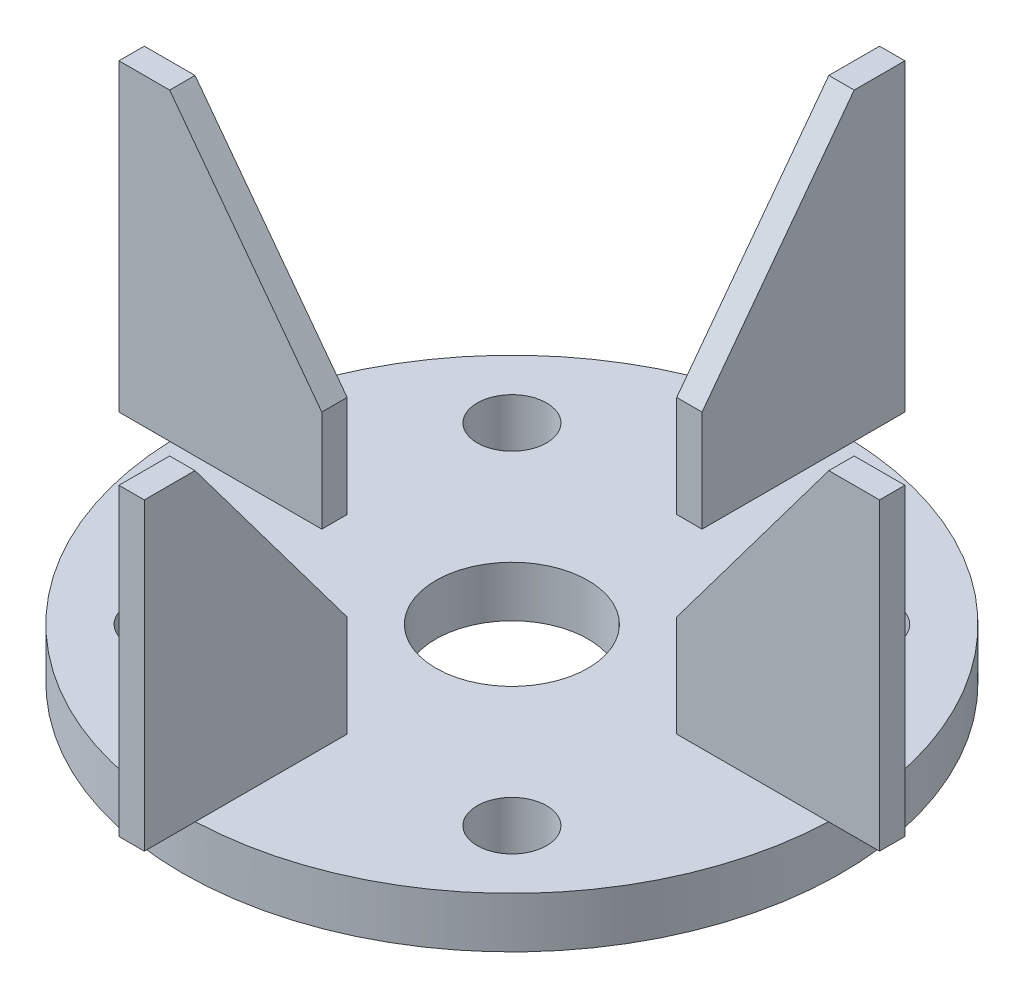
ISO-10303-21;
HEADER;
FILE_DESCRIPTION(('STEP AP214'),'2;1');
FILE_NAME('part.step','',(''),(''),'','','');
FILE_SCHEMA(('AUTOMOTIVE_DESIGN { 1 0 10303 214 1 1 1 1 }'));
ENDSEC;
DATA;
#1=APPLICATION_CONTEXT('core data for automotive mechanical design processes');
#2=APPLICATION_PROTOCOL_DEFINITION('international standard','automotive_design',2000,#1);
#3=PRODUCT_CONTEXT('',#1,'mechanical');
#4=PRODUCT('Part','Part','',(#3));
#5=PRODUCT_RELATED_PRODUCT_CATEGORY('part','',(#4));
#6=PRODUCT_DEFINITION_FORMATION('','',#4);
#7=PRODUCT_DEFINITION_CONTEXT('part definition',#1,'design');
#8=PRODUCT_DEFINITION('design','',#6,#7);
#9=PRODUCT_DEFINITION_SHAPE('','',#8);
#10=(LENGTH_UNIT() NAMED_UNIT(*) SI_UNIT(.MILLI.,.METRE.));
#11=(NAMED_UNIT(*) PLANE_ANGLE_UNIT() SI_UNIT($,.RADIAN.));
#12=(NAMED_UNIT(*) SI_UNIT($,.STERADIAN.) SOLID_ANGLE_UNIT());
#13=UNCERTAINTY_MEASURE_WITH_UNIT(LENGTH_MEASURE(1.E-05),#10,'distance_accuracy_value','');
#14=(GEOMETRIC_REPRESENTATION_CONTEXT(3) GLOBAL_UNCERTAINTY_ASSIGNED_CONTEXT((#13)) GLOBAL_UNIT_ASSIGNED_CONTEXT((#10,
#11,#12)) REPRESENTATION_CONTEXT('',''));
#15=CARTESIAN_POINT('',(0.,0.,0.));
#16=DIRECTION('',(0.,0.,1.));
#17=DIRECTION('',(1.,0.,0.));
#18=AXIS2_PLACEMENT_3D('',#15,#16,#17);
#19=CARTESIAN_POINT('',(0.,12.7,0.));
#20=DIRECTION('',(0.,1.,0.));
#21=DIRECTION('',(0.,0.,1.));
#22=AXIS2_PLACEMENT_3D('',#19,#20,#21);
#23=PLANE('',#22);
#24=CARTESIAN_POINT('',(43.6800284499293,12.7,-43.6800284499285));
#25=DIRECTION('',(0.,1.,0.));
#26=DIRECTION('',(0.,0.,1.));
#27=AXIS2_PLACEMENT_3D('',#24,#25,#26);
#28=CIRCLE('',#27,8.68663719831925);
#29=CARTESIAN_POINT('',(43.6800284499293,12.7,-34.9933912516093));
#30=VERTEX_POINT('',#29);
#31=EDGE_CURVE('E396',#30,#30,#28,.F.);
#32=ORIENTED_EDGE('',*,*,#31,.T.);
#33=EDGE_LOOP('',(#32));
#34=FACE_BOUND('',#33,.T.);
#35=CARTESIAN_POINT('',(-43.6800284499287,12.7,-43.6800284499291));
#36=DIRECTION('',(0.,1.,0.));
#37=DIRECTION('',(0.,0.,1.));
#38=AXIS2_PLACEMENT_3D('',#35,#36,#37);
#39=CIRCLE('',#38,8.68663719831925);
#40=CARTESIAN_POINT('',(-43.6800284499287,12.7,-34.9933912516099));
#41=VERTEX_POINT('',#40);
#42=EDGE_CURVE('E400',#41,#41,#39,.F.);
#43=ORIENTED_EDGE('',*,*,#42,.T.);
#44=EDGE_LOOP('',(#43));
#45=FACE_BOUND('',#44,.T.);
#46=CARTESIAN_POINT('',(-43.680028449929,12.7,43.6800284499289));
#47=DIRECTION('',(0.,1.,0.));
#48=DIRECTION('',(0.,0.,1.));
#49=AXIS2_PLACEMENT_3D('',#46,#47,#48);
#50=CIRCLE('',#49,8.68663719831924);
#51=CARTESIAN_POINT('',(-43.680028449929,12.7,52.3666656482481));
#52=VERTEX_POINT('',#51);
#53=EDGE_CURVE('E404',#52,#52,#50,.F.);
#54=ORIENTED_EDGE('',*,*,#53,.T.);
#55=EDGE_LOOP('',(#54));
#56=FACE_BOUND('',#55,.T.);
#57=CARTESIAN_POINT('',(43.680028449929,12.7,43.6800284499288));
#58=DIRECTION('',(0.,1.,0.));
#59=DIRECTION('',(0.,0.,1.));
#60=AXIS2_PLACEMENT_3D('',#57,#58,#59);
#61=CIRCLE('',#60,8.68663719831925);
#62=CARTESIAN_POINT('',(43.680028449929,12.7,52.3666656482481));
#63=VERTEX_POINT('',#62);
#64=EDGE_CURVE('E408',#63,#63,#61,.F.);
#65=ORIENTED_EDGE('',*,*,#64,.T.);
#66=EDGE_LOOP('',(#65));
#67=FACE_BOUND('',#66,.T.);
#68=CARTESIAN_POINT('',(0.,12.7,0.));
#69=DIRECTION('',(0.,1.,0.));
#70=DIRECTION('',(0.,0.,1.));
#71=AXIS2_PLACEMENT_3D('',#68,#69,#70);
#72=CIRCLE('',#71,19.05);
#73=CARTESIAN_POINT('',(0.,12.7,19.05));
#74=VERTEX_POINT('',#73);
#75=EDGE_CURVE('E346',#74,#74,#72,.T.);
#76=ORIENTED_EDGE('',*,*,#75,.F.);
#77=EDGE_LOOP('',(#76));
#78=FACE_BOUND('',#77,.T.);
#79=DIRECTION('',(0.,0.,-1.));
#80=VECTOR('',#79,1.);
#81=CARTESIAN_POINT('',(-44.45,12.7,3.17500000000047));
#82=LINE('',#81,#80);
#83=CARTESIAN_POINT('',(-44.45,12.7,3.17500000000047));
#84=VERTEX_POINT('',#83);
#85=CARTESIAN_POINT('',(-44.45,12.7,-3.17499999999953));
#86=VERTEX_POINT('',#85);
#87=EDGE_CURVE('E51',#84,#86,#82,.T.);
#88=ORIENTED_EDGE('',*,*,#87,.F.);
#89=DIRECTION('',(1.,0.,0.));
#90=VECTOR('',#89,1.);
#91=CARTESIAN_POINT('',(-44.45,12.7,3.17500000000047));
#92=LINE('',#91,#90);
#93=CARTESIAN_POINT('',(-82.4889197104678,12.7,3.17500000000086));
#94=VERTEX_POINT('',#93);
#95=EDGE_CURVE('E207',#94,#84,#92,.T.);
#96=ORIENTED_EDGE('',*,*,#95,.F.);
#97=CARTESIAN_POINT('',(0.,12.7,0.));
#98=DIRECTION('',(0.,1.,0.));
#99=DIRECTION('',(0.,0.,1.));
#100=AXIS2_PLACEMENT_3D('',#97,#98,#99);
#101=CIRCLE('',#100,82.55);
#102=CARTESIAN_POINT('',(-3.175,12.7,82.4889197104678));
#103=VERTEX_POINT('',#102);
#104=EDGE_CURVE('E353',#94,#103,#101,.T.);
#105=ORIENTED_EDGE('',*,*,#104,.T.);
#106=DIRECTION('',(0.,0.,-1.));
#107=VECTOR('',#106,1.);
#108=CARTESIAN_POINT('',(-3.175,12.7,44.45));
#109=LINE('',#108,#107);
#110=CARTESIAN_POINT('',(-3.175,12.7,44.45));
#111=VERTEX_POINT('',#110);
#112=EDGE_CURVE('E11',#103,#111,#109,.T.);
#113=ORIENTED_EDGE('',*,*,#112,.T.);
#114=DIRECTION('',(-1.,0.,0.));
#115=VECTOR('',#114,1.);
#116=CARTESIAN_POINT('',(3.175,12.7,44.45));
#117=LINE('',#116,#115);
#118=CARTESIAN_POINT('',(3.175,12.7,44.45));
#119=VERTEX_POINT('',#118);
#120=EDGE_CURVE('E336',#119,#111,#117,.T.);
#121=ORIENTED_EDGE('',*,*,#120,.F.);
#122=DIRECTION('',(0.,0.,-1.));
#123=VECTOR('',#122,1.);
#124=CARTESIAN_POINT('',(3.175,12.7,44.45));
#125=LINE('',#124,#123);
#126=CARTESIAN_POINT('',(3.175,12.7,82.4889197104678));
#127=VERTEX_POINT('',#126);
#128=EDGE_CURVE('E42',#127,#119,#125,.T.);
#129=ORIENTED_EDGE('',*,*,#128,.F.);
#130=CARTESIAN_POINT('',(82.4889197104678,12.7,3.17499999999971));
#131=VERTEX_POINT('',#130);
#132=EDGE_CURVE('E350',#127,#131,#101,.T.);
#133=ORIENTED_EDGE('',*,*,#132,.T.);
#134=DIRECTION('',(-1.,0.,0.));
#135=VECTOR('',#134,1.);
#136=CARTESIAN_POINT('',(44.45,12.7,3.17499999999984));
#137=LINE('',#136,#135);
#138=CARTESIAN_POINT('',(44.45,12.7,3.17499999999984));
#139=VERTEX_POINT('',#138);
#140=EDGE_CURVE('E287',#131,#139,#137,.T.);
#141=ORIENTED_EDGE('',*,*,#140,.T.);
#142=DIRECTION('',(0.,0.,1.));
#143=VECTOR('',#142,1.);
#144=CARTESIAN_POINT('',(44.45,12.7,-3.17500000000016));
#145=LINE('',#144,#143);
#146=CARTESIAN_POINT('',(44.45,12.7,-3.17500000000016));
#147=VERTEX_POINT('',#146);
#148=EDGE_CURVE('E299',#147,#139,#145,.T.);
#149=ORIENTED_EDGE('',*,*,#148,.F.);
#150=DIRECTION('',(-1.,0.,0.));
#151=VECTOR('',#150,1.);
#152=CARTESIAN_POINT('',(44.45,12.7,-3.17500000000016));
#153=LINE('',#152,#151);
#154=CARTESIAN_POINT('',(82.4889197104678,12.7,-3.17500000000029));
#155=VERTEX_POINT('',#154);
#156=EDGE_CURVE('E274',#155,#147,#153,.T.);
#157=ORIENTED_EDGE('',*,*,#156,.F.);
#158=CARTESIAN_POINT('',(3.175,12.7,-82.4889197104678));
#159=VERTEX_POINT('',#158);
#160=EDGE_CURVE('E359',#155,#159,#101,.T.);
#161=ORIENTED_EDGE('',*,*,#160,.T.);
#162=DIRECTION('',(0.,0.,1.));
#163=VECTOR('',#162,1.);
#164=CARTESIAN_POINT('',(3.175,12.7,-44.45));
#165=LINE('',#164,#163);
#166=CARTESIAN_POINT('',(3.175,12.7,-44.45));
#167=VERTEX_POINT('',#166);
#168=EDGE_CURVE('E246',#159,#167,#165,.T.);
#169=ORIENTED_EDGE('',*,*,#168,.T.);
#170=DIRECTION('',(1.,0.,0.));
#171=VECTOR('',#170,1.);
#172=CARTESIAN_POINT('',(-3.175,12.7,-44.45));
#173=LINE('',#172,#171);
#174=CARTESIAN_POINT('',(-3.175,12.7,-44.45));
#175=VERTEX_POINT('',#174);
#176=EDGE_CURVE('E258',#175,#167,#173,.T.);
#177=ORIENTED_EDGE('',*,*,#176,.F.);
#178=DIRECTION('',(0.,0.,1.));
#179=VECTOR('',#178,1.);
#180=CARTESIAN_POINT('',(-3.175,12.7,-44.45));
#181=LINE('',#180,#179);
#182=CARTESIAN_POINT('',(-3.175,12.7,-82.4889197104678));
#183=VERTEX_POINT('',#182);
#184=EDGE_CURVE('E236',#183,#175,#181,.T.);
#185=ORIENTED_EDGE('',*,*,#184,.F.);
#186=CARTESIAN_POINT('',(-82.4889197104678,12.7,-3.17499999999914));
#187=VERTEX_POINT('',#186);
#188=EDGE_CURVE('E591',#183,#187,#101,.T.);
#189=ORIENTED_EDGE('',*,*,#188,.T.);
#190=DIRECTION('',(1.,0.,0.));
#191=VECTOR('',#190,1.);
#192=CARTESIAN_POINT('',(-44.45,12.7,-3.17499999999953));
#193=LINE('',#192,#191);
#194=EDGE_CURVE('E56',#187,#86,#193,.T.);
#195=ORIENTED_EDGE('',*,*,#194,.T.);
#196=EDGE_LOOP('',(#88,#96,#105,#113,#121,#129,#133,#141,#149,#157,#161,#169,#177,#185,#189,#195));
#197=FACE_BOUND('',#196,.T.);
#198=ADVANCED_FACE('F33',(#34,#45,#56,#67,#78,#197),#23,.T.);
#199=CARTESIAN_POINT('',(0.,0.,0.));
#200=DIRECTION('',(0.,1.,0.));
#201=DIRECTION('',(0.,0.,1.));
#202=AXIS2_PLACEMENT_3D('',#199,#200,#201);
#203=PLANE('',#202);
#204=CARTESIAN_POINT('',(43.6800284499293,0.,-43.6800284499285));
#205=DIRECTION('',(0.,1.,0.));
#206=DIRECTION('',(0.,0.,1.));
#207=AXIS2_PLACEMENT_3D('',#204,#205,#206);
#208=CIRCLE('',#207,8.68663719831925);
#209=CARTESIAN_POINT('',(43.6800284499293,0.,-34.9933912516093));
#210=VERTEX_POINT('',#209);
#211=EDGE_CURVE('E762',#210,#210,#208,.T.);
#212=ORIENTED_EDGE('',*,*,#211,.T.);
#213=EDGE_LOOP('',(#212));
#214=FACE_BOUND('',#213,.T.);
#215=CARTESIAN_POINT('',(-43.6800284499287,0.,-43.6800284499291));
#216=DIRECTION('',(0.,1.,0.));
#217=DIRECTION('',(0.,0.,1.));
#218=AXIS2_PLACEMENT_3D('',#215,#216,#217);
#219=CIRCLE('',#218,8.68663719831925);
#220=CARTESIAN_POINT('',(-43.6800284499287,0.,-34.9933912516099));
#221=VERTEX_POINT('',#220);
#222=EDGE_CURVE('E763',#221,#221,#219,.T.);
#223=ORIENTED_EDGE('',*,*,#222,.T.);
#224=EDGE_LOOP('',(#223));
#225=FACE_BOUND('',#224,.T.);
#226=CARTESIAN_POINT('',(-43.680028449929,0.,43.6800284499289));
#227=DIRECTION('',(0.,1.,0.));
#228=DIRECTION('',(0.,0.,1.));
#229=AXIS2_PLACEMENT_3D('',#226,#227,#228);
#230=CIRCLE('',#229,8.68663719831924);
#231=CARTESIAN_POINT('',(-43.680028449929,0.,52.3666656482481));
#232=VERTEX_POINT('',#231);
#233=EDGE_CURVE('E415',#232,#232,#230,.T.);
#234=ORIENTED_EDGE('',*,*,#233,.T.);
#235=EDGE_LOOP('',(#234));
#236=FACE_BOUND('',#235,.T.);
#237=CARTESIAN_POINT('',(43.680028449929,0.,43.6800284499288));
#238=DIRECTION('',(0.,1.,0.));
#239=DIRECTION('',(0.,0.,1.));
#240=AXIS2_PLACEMENT_3D('',#237,#238,#239);
#241=CIRCLE('',#240,8.68663719831925);
#242=CARTESIAN_POINT('',(43.680028449929,0.,52.3666656482481));
#243=VERTEX_POINT('',#242);
#244=EDGE_CURVE('E411',#243,#243,#241,.T.);
#245=ORIENTED_EDGE('',*,*,#244,.T.);
#246=EDGE_LOOP('',(#245));
#247=FACE_BOUND('',#246,.T.);
#248=CARTESIAN_POINT('',(0.,0.,0.));
#249=DIRECTION('',(0.,1.,0.));
#250=DIRECTION('',(0.,0.,1.));
#251=AXIS2_PLACEMENT_3D('',#248,#249,#250);
#252=CIRCLE('',#251,82.55);
#253=CARTESIAN_POINT('',(0.,0.,82.55));
#254=VERTEX_POINT('',#253);
#255=EDGE_CURVE('E37',#254,#254,#252,.T.);
#256=ORIENTED_EDGE('',*,*,#255,.F.);
#257=EDGE_LOOP('',(#256));
#258=FACE_BOUND('',#257,.T.);
#259=CARTESIAN_POINT('',(0.,0.,0.));
#260=DIRECTION('',(0.,1.,0.));
#261=DIRECTION('',(0.,0.,1.));
#262=AXIS2_PLACEMENT_3D('',#259,#260,#261);
#263=CIRCLE('',#262,19.05);
#264=CARTESIAN_POINT('',(0.,0.,19.05));
#265=VERTEX_POINT('',#264);
#266=EDGE_CURVE('E345',#265,#265,#263,.T.);
#267=ORIENTED_EDGE('',*,*,#266,.T.);
#268=EDGE_LOOP('',(#267));
#269=FACE_BOUND('',#268,.T.);
#270=ADVANCED_FACE('F369',(#214,#225,#236,#247,#258,#269),#203,.F.);
#271=CARTESIAN_POINT('',(0.,12.7,0.));
#272=DIRECTION('',(0.,-1.,0.));
#273=DIRECTION('',(0.,0.,-1.));
#274=AXIS2_PLACEMENT_3D('',#271,#272,#273);
#275=CYLINDRICAL_SURFACE('',#274,82.55);
#276=ORIENTED_EDGE('',*,*,#132,.F.);
#277=EDGE_CURVE('E354',#103,#127,#101,.T.);
#278=ORIENTED_EDGE('',*,*,#277,.F.);
#279=ORIENTED_EDGE('',*,*,#104,.F.);
#280=EDGE_CURVE('E360',#187,#94,#101,.T.);
#281=ORIENTED_EDGE('',*,*,#280,.F.);
#282=ORIENTED_EDGE('',*,*,#188,.F.);
#283=EDGE_CURVE('E575',#159,#183,#101,.T.);
#284=ORIENTED_EDGE('',*,*,#283,.F.);
#285=ORIENTED_EDGE('',*,*,#160,.F.);
#286=EDGE_CURVE('E352',#131,#155,#101,.T.);
#287=ORIENTED_EDGE('',*,*,#286,.F.);
#288=EDGE_LOOP('',(#276,#278,#279,#281,#282,#284,#285,#287));
#289=FACE_BOUND('',#288,.T.);
#290=ORIENTED_EDGE('',*,*,#255,.T.);
#291=EDGE_LOOP('',(#290));
#292=FACE_BOUND('',#291,.T.);
#293=ADVANCED_FACE('F35',(#289,#292),#275,.T.);
#294=CARTESIAN_POINT('',(0.,12.7,0.));
#295=DIRECTION('',(0.,-1.,0.));
#296=DIRECTION('',(0.,0.,-1.));
#297=AXIS2_PLACEMENT_3D('',#294,#295,#296);
#298=CYLINDRICAL_SURFACE('',#297,19.05);
#299=ORIENTED_EDGE('',*,*,#75,.T.);
#300=EDGE_LOOP('',(#299));
#301=FACE_BOUND('',#300,.T.);
#302=ORIENTED_EDGE('',*,*,#266,.F.);
#303=EDGE_LOOP('',(#302));
#304=FACE_BOUND('',#303,.T.);
#305=ADVANCED_FACE('F375',(#301,#304),#298,.F.);
#306=CARTESIAN_POINT('',(3.175,12.7,44.45));
#307=DIRECTION('',(0.,1.,0.));
#308=DIRECTION('',(0.,0.,1.));
#309=AXIS2_PLACEMENT_3D('',#306,#307,#308);
#310=PLANE('',#309);
#311=CARTESIAN_POINT('',(-3.175,12.7,95.25));
#312=VERTEX_POINT('',#311);
#313=EDGE_CURVE('E44',#312,#103,#109,.T.);
#314=ORIENTED_EDGE('',*,*,#313,.T.);
#315=ORIENTED_EDGE('',*,*,#277,.T.);
#316=CARTESIAN_POINT('',(3.175,12.7,95.25));
#317=VERTEX_POINT('',#316);
#318=EDGE_CURVE('E315',#317,#127,#125,.T.);
#319=ORIENTED_EDGE('',*,*,#318,.F.);
#320=DIRECTION('',(-1.,0.,0.));
#321=VECTOR('',#320,1.);
#322=CARTESIAN_POINT('',(3.175,12.7,95.25));
#323=LINE('',#322,#321);
#324=EDGE_CURVE('E339',#317,#312,#323,.T.);
#325=ORIENTED_EDGE('',*,*,#324,.T.);
#326=EDGE_LOOP('',(#314,#315,#319,#325));
#327=FACE_BOUND('',#326,.T.);
#328=ADVANCED_FACE('F377',(#327),#310,.F.);
#329=CARTESIAN_POINT('',(3.175,88.9,82.55));
#330=DIRECTION('',(0.,-1.,0.));
#331=DIRECTION('',(0.,0.,-1.));
#332=AXIS2_PLACEMENT_3D('',#329,#330,#331);
#333=PLANE('',#332);
#334=DIRECTION('',(0.,0.,1.));
#335=VECTOR('',#334,1.);
#336=CARTESIAN_POINT('',(-3.175,88.9,82.55));
#337=LINE('',#336,#335);
#338=CARTESIAN_POINT('',(-3.175,88.9,82.55));
#339=VERTEX_POINT('',#338);
#340=CARTESIAN_POINT('',(-3.175,88.9,95.25));
#341=VERTEX_POINT('',#340);
#342=EDGE_CURVE('E308',#339,#341,#337,.T.);
#343=ORIENTED_EDGE('',*,*,#342,.T.);
#344=DIRECTION('',(-1.,0.,0.));
#345=VECTOR('',#344,1.);
#346=CARTESIAN_POINT('',(3.175,88.9,95.25));
#347=LINE('',#346,#345);
#348=CARTESIAN_POINT('',(3.175,88.9,95.25));
#349=VERTEX_POINT('',#348);
#350=EDGE_CURVE('E342',#349,#341,#347,.T.);
#351=ORIENTED_EDGE('',*,*,#350,.F.);
#352=DIRECTION('',(0.,0.,1.));
#353=VECTOR('',#352,1.);
#354=CARTESIAN_POINT('',(3.175,88.9,82.55));
#355=LINE('',#354,#353);
#356=CARTESIAN_POINT('',(3.175,88.9,82.55));
#357=VERTEX_POINT('',#356);
#358=EDGE_CURVE('E309',#357,#349,#355,.T.);
#359=ORIENTED_EDGE('',*,*,#358,.F.);
#360=DIRECTION('',(-1.,0.,0.));
#361=VECTOR('',#360,1.);
#362=CARTESIAN_POINT('',(3.175,88.9,82.55));
#363=LINE('',#362,#361);
#364=EDGE_CURVE('E322',#357,#339,#363,.T.);
#365=ORIENTED_EDGE('',*,*,#364,.T.);
#366=EDGE_LOOP('',(#343,#351,#359,#365));
#367=FACE_BOUND('',#366,.T.);
#368=ADVANCED_FACE('F384',(#367),#333,.F.);
#369=CARTESIAN_POINT('',(3.175,12.7,95.25));
#370=DIRECTION('',(0.,0.,-1.));
#371=DIRECTION('',(-1.,0.,0.));
#372=AXIS2_PLACEMENT_3D('',#369,#370,#371);
#373=PLANE('',#372);
#374=DIRECTION('',(0.,-1.,0.));
#375=VECTOR('',#374,1.);
#376=CARTESIAN_POINT('',(-3.175,12.7,95.25));
#377=LINE('',#376,#375);
#378=EDGE_CURVE('E325',#341,#312,#377,.T.);
#379=ORIENTED_EDGE('',*,*,#378,.T.);
#380=ORIENTED_EDGE('',*,*,#324,.F.);
#381=DIRECTION('',(0.,-1.,0.));
#382=VECTOR('',#381,1.);
#383=CARTESIAN_POINT('',(3.175,12.7,95.25));
#384=LINE('',#383,#382);
#385=EDGE_CURVE('E312',#349,#317,#384,.T.);
#386=ORIENTED_EDGE('',*,*,#385,.F.);
#387=ORIENTED_EDGE('',*,*,#350,.T.);
#388=EDGE_LOOP('',(#379,#380,#386,#387));
#389=FACE_BOUND('',#388,.T.);
#390=ADVANCED_FACE('F538',(#389),#373,.F.);
#391=CARTESIAN_POINT('',(3.175,38.1,44.45));
#392=DIRECTION('',(0.,0.,1.));
#393=DIRECTION('',(0.,-1.,0.));
#394=AXIS2_PLACEMENT_3D('',#391,#392,#393);
#395=PLANE('',#394);
#396=DIRECTION('',(0.,1.,0.));
#397=VECTOR('',#396,1.);
#398=CARTESIAN_POINT('',(-3.175,38.1,44.45));
#399=LINE('',#398,#397);
#400=CARTESIAN_POINT('',(-3.175,38.1,44.45));
#401=VERTEX_POINT('',#400);
#402=EDGE_CURVE('E328',#111,#401,#399,.T.);
#403=ORIENTED_EDGE('',*,*,#402,.T.);
#404=DIRECTION('',(-1.,0.,0.));
#405=VECTOR('',#404,1.);
#406=CARTESIAN_POINT('',(3.175,38.1,44.45));
#407=LINE('',#406,#405);
#408=CARTESIAN_POINT('',(3.175,38.1,44.45));
#409=VERTEX_POINT('',#408);
#410=EDGE_CURVE('E333',#409,#401,#407,.T.);
#411=ORIENTED_EDGE('',*,*,#410,.F.);
#412=DIRECTION('',(0.,1.,0.));
#413=VECTOR('',#412,1.);
#414=CARTESIAN_POINT('',(3.175,38.1,44.45));
#415=LINE('',#414,#413);
#416=EDGE_CURVE('E318',#119,#409,#415,.T.);
#417=ORIENTED_EDGE('',*,*,#416,.F.);
#418=ORIENTED_EDGE('',*,*,#120,.T.);
#419=EDGE_LOOP('',(#403,#411,#417,#418));
#420=FACE_BOUND('',#419,.T.);
#421=ADVANCED_FACE('F535',(#420),#395,.F.);
#422=CARTESIAN_POINT('',(3.175,88.9,82.55));
#423=DIRECTION('',(0.,-0.6,0.8));
#424=DIRECTION('',(0.,-0.8,-0.6));
#425=AXIS2_PLACEMENT_3D('',#422,#423,#424);
#426=PLANE('',#425);
#427=DIRECTION('',(0.,0.8,0.6));
#428=VECTOR('',#427,1.);
#429=CARTESIAN_POINT('',(-3.175,88.9,82.55));
#430=LINE('',#429,#428);
#431=EDGE_CURVE('E313',#401,#339,#430,.T.);
#432=ORIENTED_EDGE('',*,*,#431,.T.);
#433=ORIENTED_EDGE('',*,*,#364,.F.);
#434=DIRECTION('',(0.,0.8,0.6));
#435=VECTOR('',#434,1.);
#436=CARTESIAN_POINT('',(3.175,88.9,82.55));
#437=LINE('',#436,#435);
#438=EDGE_CURVE('E320',#409,#357,#437,.T.);
#439=ORIENTED_EDGE('',*,*,#438,.F.);
#440=ORIENTED_EDGE('',*,*,#410,.T.);
#441=EDGE_LOOP('',(#432,#433,#439,#440));
#442=FACE_BOUND('',#441,.T.);
#443=ADVANCED_FACE('F528',(#442),#426,.F.);
#444=CARTESIAN_POINT('',(3.175,0.,0.));
#445=DIRECTION('',(-1.,0.,0.));
#446=DIRECTION('',(0.,0.,1.));
#447=AXIS2_PLACEMENT_3D('',#444,#445,#446);
#448=PLANE('',#447);
#449=ORIENTED_EDGE('',*,*,#358,.T.);
#450=ORIENTED_EDGE('',*,*,#385,.T.);
#451=ORIENTED_EDGE('',*,*,#318,.T.);
#452=ORIENTED_EDGE('',*,*,#128,.T.);
#453=ORIENTED_EDGE('',*,*,#416,.T.);
#454=ORIENTED_EDGE('',*,*,#438,.T.);
#455=EDGE_LOOP('',(#449,#450,#451,#452,#453,#454));
#456=FACE_BOUND('',#455,.T.);
#457=ADVANCED_FACE('F525',(#456),#448,.F.);
#458=CARTESIAN_POINT('',(-3.175,0.,0.));
#459=DIRECTION('',(-1.,0.,0.));
#460=DIRECTION('',(0.,0.,1.));
#461=AXIS2_PLACEMENT_3D('',#458,#459,#460);
#462=PLANE('',#461);
#463=ORIENTED_EDGE('',*,*,#342,.F.);
#464=ORIENTED_EDGE('',*,*,#431,.F.);
#465=ORIENTED_EDGE('',*,*,#402,.F.);
#466=ORIENTED_EDGE('',*,*,#112,.F.);
#467=ORIENTED_EDGE('',*,*,#313,.F.);
#468=ORIENTED_EDGE('',*,*,#378,.F.);
#469=EDGE_LOOP('',(#463,#464,#465,#466,#467,#468));
#470=FACE_BOUND('',#469,.T.);
#471=ADVANCED_FACE('F523',(#470),#462,.T.);
#472=CARTESIAN_POINT('',(82.55,88.9,-3.17500000000029));
#473=DIRECTION('',(0.,-1.,0.));
#474=DIRECTION('',(0.,0.,-1.));
#475=AXIS2_PLACEMENT_3D('',#472,#473,#474);
#476=PLANE('',#475);
#477=DIRECTION('',(1.,0.,0.));
#478=VECTOR('',#477,1.);
#479=CARTESIAN_POINT('',(82.55,88.9,3.17499999999971));
#480=LINE('',#479,#478);
#481=CARTESIAN_POINT('',(82.55,88.9,3.17499999999971));
#482=VERTEX_POINT('',#481);
#483=CARTESIAN_POINT('',(95.25,88.9,3.17499999999967));
#484=VERTEX_POINT('',#483);
#485=EDGE_CURVE('E267',#482,#484,#480,.T.);
#486=ORIENTED_EDGE('',*,*,#485,.T.);
#487=DIRECTION('',(0.,0.,1.));
#488=VECTOR('',#487,1.);
#489=CARTESIAN_POINT('',(95.25,88.9,-3.17500000000033));
#490=LINE('',#489,#488);
#491=CARTESIAN_POINT('',(95.25,88.9,-3.17500000000033));
#492=VERTEX_POINT('',#491);
#493=EDGE_CURVE('E305',#492,#484,#490,.T.);
#494=ORIENTED_EDGE('',*,*,#493,.F.);
#495=DIRECTION('',(1.,0.,0.));
#496=VECTOR('',#495,1.);
#497=CARTESIAN_POINT('',(82.55,88.9,-3.17500000000029));
#498=LINE('',#497,#496);
#499=CARTESIAN_POINT('',(82.55,88.9,-3.17500000000029));
#500=VERTEX_POINT('',#499);
#501=EDGE_CURVE('E268',#500,#492,#498,.T.);
#502=ORIENTED_EDGE('',*,*,#501,.F.);
#503=DIRECTION('',(0.,0.,1.));
#504=VECTOR('',#503,1.);
#505=CARTESIAN_POINT('',(82.55,88.9,-3.17500000000029));
#506=LINE('',#505,#504);
#507=EDGE_CURVE('E282',#500,#482,#506,.T.);
#508=ORIENTED_EDGE('',*,*,#507,.T.);
#509=EDGE_LOOP('',(#486,#494,#502,#508));
#510=FACE_BOUND('',#509,.T.);
#511=ADVANCED_FACE('F519',(#510),#476,.F.);
#512=CARTESIAN_POINT('',(95.25,12.7,-3.17500000000033));
#513=DIRECTION('',(-1.,0.,0.));
#514=DIRECTION('',(0.,0.,1.));
#515=AXIS2_PLACEMENT_3D('',#512,#513,#514);
#516=PLANE('',#515);
#517=DIRECTION('',(0.,-1.,0.));
#518=VECTOR('',#517,1.);
#519=CARTESIAN_POINT('',(95.25,12.7,3.17499999999967));
#520=LINE('',#519,#518);
#521=CARTESIAN_POINT('',(95.25,12.7,3.17499999999967));
#522=VERTEX_POINT('',#521);
#523=EDGE_CURVE('E285',#484,#522,#520,.T.);
#524=ORIENTED_EDGE('',*,*,#523,.T.);
#525=DIRECTION('',(0.,0.,1.));
#526=VECTOR('',#525,1.);
#527=CARTESIAN_POINT('',(95.25,12.7,-3.17500000000033));
#528=LINE('',#527,#526);
#529=CARTESIAN_POINT('',(95.25,12.7,-3.17500000000033));
#530=VERTEX_POINT('',#529);
#531=EDGE_CURVE('E302',#530,#522,#528,.T.);
#532=ORIENTED_EDGE('',*,*,#531,.F.);
#533=DIRECTION('',(0.,-1.,0.));
#534=VECTOR('',#533,1.);
#535=CARTESIAN_POINT('',(95.25,12.7,-3.17500000000033));
#536=LINE('',#535,#534);
#537=EDGE_CURVE('E271',#492,#530,#536,.T.);
#538=ORIENTED_EDGE('',*,*,#537,.F.);
#539=ORIENTED_EDGE('',*,*,#493,.T.);
#540=EDGE_LOOP('',(#524,#532,#538,#539));
#541=FACE_BOUND('',#540,.T.);
#542=ADVANCED_FACE('F515',(#541),#516,.F.);
#543=CARTESIAN_POINT('',(44.45,12.7,-3.17500000000016));
#544=DIRECTION('',(0.,1.,0.));
#545=DIRECTION('',(-1.,0.,0.));
#546=AXIS2_PLACEMENT_3D('',#543,#544,#545);
#547=PLANE('',#546);
#548=EDGE_CURVE('E288',#522,#131,#137,.T.);
#549=ORIENTED_EDGE('',*,*,#548,.T.);
#550=ORIENTED_EDGE('',*,*,#286,.T.);
#551=EDGE_CURVE('E275',#530,#155,#153,.T.);
#552=ORIENTED_EDGE('',*,*,#551,.F.);
#553=ORIENTED_EDGE('',*,*,#531,.T.);
#554=EDGE_LOOP('',(#549,#550,#552,#553));
#555=FACE_BOUND('',#554,.T.);
#556=ADVANCED_FACE('F511',(#555),#547,.F.);
#557=CARTESIAN_POINT('',(44.45,38.1,-3.17500000000016));
#558=DIRECTION('',(1.,0.,0.));
#559=DIRECTION('',(0.,0.,-1.));
#560=AXIS2_PLACEMENT_3D('',#557,#558,#559);
#561=PLANE('',#560);
#562=DIRECTION('',(0.,1.,0.));
#563=VECTOR('',#562,1.);
#564=CARTESIAN_POINT('',(44.45,38.1,3.17499999999984));
#565=LINE('',#564,#563);
#566=CARTESIAN_POINT('',(44.45,38.1,3.17499999999984));
#567=VERTEX_POINT('',#566);
#568=EDGE_CURVE('E291',#139,#567,#565,.T.);
#569=ORIENTED_EDGE('',*,*,#568,.T.);
#570=DIRECTION('',(0.,0.,1.));
#571=VECTOR('',#570,1.);
#572=CARTESIAN_POINT('',(44.45,38.1,-3.17500000000016));
#573=LINE('',#572,#571);
#574=CARTESIAN_POINT('',(44.45,38.1,-3.17500000000016));
#575=VERTEX_POINT('',#574);
#576=EDGE_CURVE('E296',#575,#567,#573,.T.);
#577=ORIENTED_EDGE('',*,*,#576,.F.);
#578=DIRECTION('',(0.,1.,0.));
#579=VECTOR('',#578,1.);
#580=CARTESIAN_POINT('',(44.45,38.1,-3.17500000000016));
#581=LINE('',#580,#579);
#582=EDGE_CURVE('E278',#147,#575,#581,.T.);
#583=ORIENTED_EDGE('',*,*,#582,.F.);
#584=ORIENTED_EDGE('',*,*,#148,.T.);
#585=EDGE_LOOP('',(#569,#577,#583,#584));
#586=FACE_BOUND('',#585,.T.);
#587=ADVANCED_FACE('F507',(#586),#561,.F.);
#588=CARTESIAN_POINT('',(82.55,88.9,-3.17500000000029));
#589=DIRECTION('',(0.8,-0.6,0.));
#590=DIRECTION('',(0.6,0.8,0.));
#591=AXIS2_PLACEMENT_3D('',#588,#589,#590);
#592=PLANE('',#591);
#593=DIRECTION('',(0.6,0.8,0.));
#594=VECTOR('',#593,1.);
#595=CARTESIAN_POINT('',(82.55,88.9,3.17499999999971));
#596=LINE('',#595,#594);
#597=EDGE_CURVE('E272',#567,#482,#596,.T.);
#598=ORIENTED_EDGE('',*,*,#597,.T.);
#599=ORIENTED_EDGE('',*,*,#507,.F.);
#600=DIRECTION('',(0.6,0.8,0.));
#601=VECTOR('',#600,1.);
#602=CARTESIAN_POINT('',(82.55,88.9,-3.17500000000029));
#603=LINE('',#602,#601);
#604=EDGE_CURVE('E280',#575,#500,#603,.T.);
#605=ORIENTED_EDGE('',*,*,#604,.F.);
#606=ORIENTED_EDGE('',*,*,#576,.T.);
#607=EDGE_LOOP('',(#598,#599,#605,#606));
#608=FACE_BOUND('',#607,.T.);
#609=ADVANCED_FACE('F500',(#608),#592,.F.);
#610=CARTESIAN_POINT('',(0.,0.,-3.175));
#611=DIRECTION('',(0.,0.,1.));
#612=DIRECTION('',(1.,0.,0.));
#613=AXIS2_PLACEMENT_3D('',#610,#611,#612);
#614=PLANE('',#613);
#615=ORIENTED_EDGE('',*,*,#501,.T.);
#616=ORIENTED_EDGE('',*,*,#537,.T.);
#617=ORIENTED_EDGE('',*,*,#551,.T.);
#618=ORIENTED_EDGE('',*,*,#156,.T.);
#619=ORIENTED_EDGE('',*,*,#582,.T.);
#620=ORIENTED_EDGE('',*,*,#604,.T.);
#621=EDGE_LOOP('',(#615,#616,#617,#618,#619,#620));
#622=FACE_BOUND('',#621,.T.);
#623=ADVANCED_FACE('F497',(#622),#614,.F.);
#624=CARTESIAN_POINT('',(0.,0.,3.175));
#625=DIRECTION('',(0.,0.,1.));
#626=DIRECTION('',(1.,0.,0.));
#627=AXIS2_PLACEMENT_3D('',#624,#625,#626);
#628=PLANE('',#627);
#629=ORIENTED_EDGE('',*,*,#485,.F.);
#630=ORIENTED_EDGE('',*,*,#597,.F.);
#631=ORIENTED_EDGE('',*,*,#568,.F.);
#632=ORIENTED_EDGE('',*,*,#140,.F.);
#633=ORIENTED_EDGE('',*,*,#548,.F.);
#634=ORIENTED_EDGE('',*,*,#523,.F.);
#635=EDGE_LOOP('',(#629,#630,#631,#632,#633,#634));
#636=FACE_BOUND('',#635,.T.);
#637=ADVANCED_FACE('F495',(#636),#628,.T.);
#638=CARTESIAN_POINT('',(-3.175,88.9,-82.55));
#639=DIRECTION('',(0.,-1.,0.));
#640=DIRECTION('',(0.,0.,-1.));
#641=AXIS2_PLACEMENT_3D('',#638,#639,#640);
#642=PLANE('',#641);
#643=DIRECTION('',(0.,0.,-1.));
#644=VECTOR('',#643,1.);
#645=CARTESIAN_POINT('',(3.175,88.9,-82.55));
#646=LINE('',#645,#644);
#647=CARTESIAN_POINT('',(3.175,88.9,-82.55));
#648=VERTEX_POINT('',#647);
#649=CARTESIAN_POINT('',(3.175,88.9,-95.25));
#650=VERTEX_POINT('',#649);
#651=EDGE_CURVE('E222',#648,#650,#646,.T.);
#652=ORIENTED_EDGE('',*,*,#651,.T.);
#653=DIRECTION('',(1.,0.,0.));
#654=VECTOR('',#653,1.);
#655=CARTESIAN_POINT('',(-3.175,88.9,-95.25));
#656=LINE('',#655,#654);
#657=CARTESIAN_POINT('',(-3.175,88.9,-95.25));
#658=VERTEX_POINT('',#657);
#659=EDGE_CURVE('E264',#658,#650,#656,.T.);
#660=ORIENTED_EDGE('',*,*,#659,.F.);
#661=DIRECTION('',(0.,0.,-1.));
#662=VECTOR('',#661,1.);
#663=CARTESIAN_POINT('',(-3.175,88.9,-82.55));
#664=LINE('',#663,#662);
#665=CARTESIAN_POINT('',(-3.175,88.9,-82.55));
#666=VERTEX_POINT('',#665);
#667=EDGE_CURVE('E230',#666,#658,#664,.T.);
#668=ORIENTED_EDGE('',*,*,#667,.F.);
#669=DIRECTION('',(1.,0.,0.));
#670=VECTOR('',#669,1.);
#671=CARTESIAN_POINT('',(-3.175,88.9,-82.55));
#672=LINE('',#671,#670);
#673=EDGE_CURVE('E243',#666,#648,#672,.T.);
#674=ORIENTED_EDGE('',*,*,#673,.T.);
#675=EDGE_LOOP('',(#652,#660,#668,#674));
#676=FACE_BOUND('',#675,.T.);
#677=ADVANCED_FACE('F491',(#676),#642,.F.);
#678=CARTESIAN_POINT('',(-3.175,12.7,-95.25));
#679=DIRECTION('',(0.,0.,1.));
#680=DIRECTION('',(1.,0.,0.));
#681=AXIS2_PLACEMENT_3D('',#678,#679,#680);
#682=PLANE('',#681);
#683=DIRECTION('',(0.,-1.,0.));
#684=VECTOR('',#683,1.);
#685=CARTESIAN_POINT('',(3.175,12.7,-95.25));
#686=LINE('',#685,#684);
#687=CARTESIAN_POINT('',(3.175,12.7,-95.25));
#688=VERTEX_POINT('',#687);
#689=EDGE_CURVE('E225',#650,#688,#686,.T.);
#690=ORIENTED_EDGE('',*,*,#689,.T.);
#691=DIRECTION('',(1.,0.,0.));
#692=VECTOR('',#691,1.);
#693=CARTESIAN_POINT('',(-3.175,12.7,-95.25));
#694=LINE('',#693,#692);
#695=CARTESIAN_POINT('',(-3.175,12.7,-95.25));
#696=VERTEX_POINT('',#695);
#697=EDGE_CURVE('E261',#696,#688,#694,.T.);
#698=ORIENTED_EDGE('',*,*,#697,.F.);
#699=DIRECTION('',(0.,-1.,0.));
#700=VECTOR('',#699,1.);
#701=CARTESIAN_POINT('',(-3.175,12.7,-95.25));
#702=LINE('',#701,#700);
#703=EDGE_CURVE('E233',#658,#696,#702,.T.);
#704=ORIENTED_EDGE('',*,*,#703,.F.);
#705=ORIENTED_EDGE('',*,*,#659,.T.);
#706=EDGE_LOOP('',(#690,#698,#704,#705));
#707=FACE_BOUND('',#706,.T.);
#708=ADVANCED_FACE('F487',(#707),#682,.F.);
#709=CARTESIAN_POINT('',(-3.175,12.7,-44.45));
#710=DIRECTION('',(0.,1.,0.));
#711=DIRECTION('',(0.,0.,1.));
#712=AXIS2_PLACEMENT_3D('',#709,#710,#711);
#713=PLANE('',#712);
#714=EDGE_CURVE('E247',#688,#159,#165,.T.);
#715=ORIENTED_EDGE('',*,*,#714,.T.);
#716=ORIENTED_EDGE('',*,*,#283,.T.);
#717=EDGE_CURVE('E237',#696,#183,#181,.T.);
#718=ORIENTED_EDGE('',*,*,#717,.F.);
#719=ORIENTED_EDGE('',*,*,#697,.T.);
#720=EDGE_LOOP('',(#715,#716,#718,#719));
#721=FACE_BOUND('',#720,.T.);
#722=ADVANCED_FACE('F483',(#721),#713,.F.);
#723=CARTESIAN_POINT('',(-3.175,38.1,-44.45));
#724=DIRECTION('',(0.,0.,-1.));
#725=DIRECTION('',(0.,1.,0.));
#726=AXIS2_PLACEMENT_3D('',#723,#724,#725);
#727=PLANE('',#726);
#728=DIRECTION('',(0.,1.,0.));
#729=VECTOR('',#728,1.);
#730=CARTESIAN_POINT('',(3.175,38.1,-44.45));
#731=LINE('',#730,#729);
#732=CARTESIAN_POINT('',(3.175,38.1,-44.45));
#733=VERTEX_POINT('',#732);
#734=EDGE_CURVE('E250',#167,#733,#731,.T.);
#735=ORIENTED_EDGE('',*,*,#734,.T.);
#736=DIRECTION('',(1.,0.,0.));
#737=VECTOR('',#736,1.);
#738=CARTESIAN_POINT('',(-3.175,38.1,-44.45));
#739=LINE('',#738,#737);
#740=CARTESIAN_POINT('',(-3.175,38.1,-44.45));
#741=VERTEX_POINT('',#740);
#742=EDGE_CURVE('E255',#741,#733,#739,.T.);
#743=ORIENTED_EDGE('',*,*,#742,.F.);
#744=DIRECTION('',(0.,1.,0.));
#745=VECTOR('',#744,1.);
#746=CARTESIAN_POINT('',(-3.175,38.1,-44.45));
#747=LINE('',#746,#745);
#748=EDGE_CURVE('E240',#175,#741,#747,.T.);
#749=ORIENTED_EDGE('',*,*,#748,.F.);
#750=ORIENTED_EDGE('',*,*,#176,.T.);
#751=EDGE_LOOP('',(#735,#743,#749,#750));
#752=FACE_BOUND('',#751,.T.);
#753=ADVANCED_FACE('F479',(#752),#727,.F.);
#754=CARTESIAN_POINT('',(-3.175,88.9,-82.55));
#755=DIRECTION('',(0.,-0.6,-0.8));
#756=DIRECTION('',(0.,0.8,-0.6));
#757=AXIS2_PLACEMENT_3D('',#754,#755,#756);
#758=PLANE('',#757);
#759=DIRECTION('',(0.,0.8,-0.6));
#760=VECTOR('',#759,1.);
#761=CARTESIAN_POINT('',(3.175,88.9,-82.55));
#762=LINE('',#761,#760);
#763=EDGE_CURVE('E234',#733,#648,#762,.T.);
#764=ORIENTED_EDGE('',*,*,#763,.T.);
#765=ORIENTED_EDGE('',*,*,#673,.F.);
#766=DIRECTION('',(0.,0.8,-0.6));
#767=VECTOR('',#766,1.);
#768=CARTESIAN_POINT('',(-3.175,88.9,-82.55));
#769=LINE('',#768,#767);
#770=EDGE_CURVE('E242',#741,#666,#769,.T.);
#771=ORIENTED_EDGE('',*,*,#770,.F.);
#772=ORIENTED_EDGE('',*,*,#742,.T.);
#773=EDGE_LOOP('',(#764,#765,#771,#772));
#774=FACE_BOUND('',#773,.T.);
#775=ADVANCED_FACE('F472',(#774),#758,.F.);
#776=CARTESIAN_POINT('',(-3.175,0.,0.));
#777=DIRECTION('',(1.,0.,0.));
#778=DIRECTION('',(0.,0.,-1.));
#779=AXIS2_PLACEMENT_3D('',#776,#777,#778);
#780=PLANE('',#779);
#781=ORIENTED_EDGE('',*,*,#667,.T.);
#782=ORIENTED_EDGE('',*,*,#703,.T.);
#783=ORIENTED_EDGE('',*,*,#717,.T.);
#784=ORIENTED_EDGE('',*,*,#184,.T.);
#785=ORIENTED_EDGE('',*,*,#748,.T.);
#786=ORIENTED_EDGE('',*,*,#770,.T.);
#787=EDGE_LOOP('',(#781,#782,#783,#784,#785,#786));
#788=FACE_BOUND('',#787,.T.);
#789=ADVANCED_FACE('F469',(#788),#780,.F.);
#790=CARTESIAN_POINT('',(3.175,0.,0.));
#791=DIRECTION('',(1.,0.,0.));
#792=DIRECTION('',(0.,0.,-1.));
#793=AXIS2_PLACEMENT_3D('',#790,#791,#792);
#794=PLANE('',#793);
#795=ORIENTED_EDGE('',*,*,#651,.F.);
#796=ORIENTED_EDGE('',*,*,#763,.F.);
#797=ORIENTED_EDGE('',*,*,#734,.F.);
#798=ORIENTED_EDGE('',*,*,#168,.F.);
#799=ORIENTED_EDGE('',*,*,#714,.F.);
#800=ORIENTED_EDGE('',*,*,#689,.F.);
#801=EDGE_LOOP('',(#795,#796,#797,#798,#799,#800));
#802=FACE_BOUND('',#801,.T.);
#803=ADVANCED_FACE('F468',(#802),#794,.T.);
#804=CARTESIAN_POINT('',(-82.55,88.9,3.17500000000086));
#805=DIRECTION('',(0.,-1.,0.));
#806=DIRECTION('',(0.,0.,-1.));
#807=AXIS2_PLACEMENT_3D('',#804,#805,#806);
#808=PLANE('',#807);
#809=DIRECTION('',(-1.,0.,0.));
#810=VECTOR('',#809,1.);
#811=CARTESIAN_POINT('',(-82.55,88.9,-3.17499999999914));
#812=LINE('',#811,#810);
#813=CARTESIAN_POINT('',(-82.55,88.9,-3.17499999999914));
#814=VERTEX_POINT('',#813);
#815=CARTESIAN_POINT('',(-95.25,88.9,-3.174999999999));
#816=VERTEX_POINT('',#815);
#817=EDGE_CURVE('E221',#814,#816,#812,.T.);
#818=ORIENTED_EDGE('',*,*,#817,.T.);
#819=DIRECTION('',(0.,0.,-1.));
#820=VECTOR('',#819,1.);
#821=CARTESIAN_POINT('',(-95.25,88.9,3.175000000001));
#822=LINE('',#821,#820);
#823=CARTESIAN_POINT('',(-95.25,88.9,3.175000000001));
#824=VERTEX_POINT('',#823);
#825=EDGE_CURVE('E200',#824,#816,#822,.T.);
#826=ORIENTED_EDGE('',*,*,#825,.F.);
#827=DIRECTION('',(-1.,0.,0.));
#828=VECTOR('',#827,1.);
#829=CARTESIAN_POINT('',(-82.55,88.9,3.17500000000086));
#830=LINE('',#829,#828);
#831=CARTESIAN_POINT('',(-82.55,88.9,3.17500000000086));
#832=VERTEX_POINT('',#831);
#833=EDGE_CURVE('E208',#832,#824,#830,.T.);
#834=ORIENTED_EDGE('',*,*,#833,.F.);
#835=DIRECTION('',(0.,0.,-1.));
#836=VECTOR('',#835,1.);
#837=CARTESIAN_POINT('',(-82.55,88.9,3.17500000000086));
#838=LINE('',#837,#836);
#839=EDGE_CURVE('E426',#832,#814,#838,.T.);
#840=ORIENTED_EDGE('',*,*,#839,.T.);
#841=EDGE_LOOP('',(#818,#826,#834,#840));
#842=FACE_BOUND('',#841,.T.);
#843=ADVANCED_FACE('F219',(#842),#808,.F.);
#844=CARTESIAN_POINT('',(-95.25,12.7,3.175000000001));
#845=DIRECTION('',(1.,0.,0.));
#846=DIRECTION('',(0.,0.,-1.));
#847=AXIS2_PLACEMENT_3D('',#844,#845,#846);
#848=PLANE('',#847);
#849=DIRECTION('',(0.,-1.,0.));
#850=VECTOR('',#849,1.);
#851=CARTESIAN_POINT('',(-95.25,12.7,-3.174999999999));
#852=LINE('',#851,#850);
#853=CARTESIAN_POINT('',(-95.25,12.7,-3.174999999999));
#854=VERTEX_POINT('',#853);
#855=EDGE_CURVE('E428',#816,#854,#852,.T.);
#856=ORIENTED_EDGE('',*,*,#855,.T.);
#857=DIRECTION('',(0.,0.,-1.));
#858=VECTOR('',#857,1.);
#859=CARTESIAN_POINT('',(-95.25,12.7,3.175000000001));
#860=LINE('',#859,#858);
#861=CARTESIAN_POINT('',(-95.25,12.7,3.175000000001));
#862=VERTEX_POINT('',#861);
#863=EDGE_CURVE('E203',#862,#854,#860,.T.);
#864=ORIENTED_EDGE('',*,*,#863,.F.);
#865=DIRECTION('',(0.,-1.,0.));
#866=VECTOR('',#865,1.);
#867=CARTESIAN_POINT('',(-95.25,12.7,3.175000000001));
#868=LINE('',#867,#866);
#869=EDGE_CURVE('E196',#824,#862,#868,.T.);
#870=ORIENTED_EDGE('',*,*,#869,.F.);
#871=ORIENTED_EDGE('',*,*,#825,.T.);
#872=EDGE_LOOP('',(#856,#864,#870,#871));
#873=FACE_BOUND('',#872,.T.);
#874=ADVANCED_FACE('F198',(#873),#848,.F.);
#875=CARTESIAN_POINT('',(-44.45,12.7,3.17500000000047));
#876=DIRECTION('',(0.,1.,0.));
#877=DIRECTION('',(-1.,0.,0.));
#878=AXIS2_PLACEMENT_3D('',#875,#876,#877);
#879=PLANE('',#878);
#880=EDGE_CURVE('E430',#854,#187,#193,.T.);
#881=ORIENTED_EDGE('',*,*,#880,.T.);
#882=ORIENTED_EDGE('',*,*,#280,.T.);
#883=EDGE_CURVE('E421',#862,#94,#92,.T.);
#884=ORIENTED_EDGE('',*,*,#883,.F.);
#885=ORIENTED_EDGE('',*,*,#863,.T.);
#886=EDGE_LOOP('',(#881,#882,#884,#885));
#887=FACE_BOUND('',#886,.T.);
#888=ADVANCED_FACE('F457',(#887),#879,.F.);
#889=CARTESIAN_POINT('',(-44.45,38.1,3.17500000000047));
#890=DIRECTION('',(-1.,0.,0.));
#891=DIRECTION('',(0.,0.,1.));
#892=AXIS2_PLACEMENT_3D('',#889,#890,#891);
#893=PLANE('',#892);
#894=DIRECTION('',(0.,1.,0.));
#895=VECTOR('',#894,1.);
#896=CARTESIAN_POINT('',(-44.45,38.1,-3.17499999999953));
#897=LINE('',#896,#895);
#898=CARTESIAN_POINT('',(-44.45,38.1,-3.17499999999953));
#899=VERTEX_POINT('',#898);
#900=EDGE_CURVE('E433',#86,#899,#897,.T.);
#901=ORIENTED_EDGE('',*,*,#900,.T.);
#902=DIRECTION('',(0.,0.,-1.));
#903=VECTOR('',#902,1.);
#904=CARTESIAN_POINT('',(-44.45,38.1,3.17500000000047));
#905=LINE('',#904,#903);
#906=CARTESIAN_POINT('',(-44.45,38.1,3.17500000000047));
#907=VERTEX_POINT('',#906);
#908=EDGE_CURVE('E437',#907,#899,#905,.T.);
#909=ORIENTED_EDGE('',*,*,#908,.F.);
#910=DIRECTION('',(0.,1.,0.));
#911=VECTOR('',#910,1.);
#912=CARTESIAN_POINT('',(-44.45,38.1,3.17500000000047));
#913=LINE('',#912,#911);
#914=EDGE_CURVE('E423',#84,#907,#913,.T.);
#915=ORIENTED_EDGE('',*,*,#914,.F.);
#916=ORIENTED_EDGE('',*,*,#87,.T.);
#917=EDGE_LOOP('',(#901,#909,#915,#916));
#918=FACE_BOUND('',#917,.T.);
#919=ADVANCED_FACE('F442',(#918),#893,.F.);
#920=CARTESIAN_POINT('',(-82.55,88.9,3.17500000000086));
#921=DIRECTION('',(-0.8,-0.6,0.));
#922=DIRECTION('',(0.6,-0.8,0.));
#923=AXIS2_PLACEMENT_3D('',#920,#921,#922);
#924=PLANE('',#923);
#925=DIRECTION('',(-0.6,0.8,0.));
#926=VECTOR('',#925,1.);
#927=CARTESIAN_POINT('',(-82.55,88.9,-3.17499999999914));
#928=LINE('',#927,#926);
#929=EDGE_CURVE('E217',#899,#814,#928,.T.);
#930=ORIENTED_EDGE('',*,*,#929,.T.);
#931=ORIENTED_EDGE('',*,*,#839,.F.);
#932=DIRECTION('',(-0.6,0.8,0.));
#933=VECTOR('',#932,1.);
#934=CARTESIAN_POINT('',(-82.55,88.9,3.17500000000086));
#935=LINE('',#934,#933);
#936=EDGE_CURVE('E213',#907,#832,#935,.T.);
#937=ORIENTED_EDGE('',*,*,#936,.F.);
#938=ORIENTED_EDGE('',*,*,#908,.T.);
#939=EDGE_LOOP('',(#930,#931,#937,#938));
#940=FACE_BOUND('',#939,.T.);
#941=ADVANCED_FACE('F449',(#940),#924,.F.);
#942=CARTESIAN_POINT('',(0.,0.,3.175));
#943=DIRECTION('',(0.,0.,-1.));
#944=DIRECTION('',(-1.,0.,0.));
#945=AXIS2_PLACEMENT_3D('',#942,#943,#944);
#946=PLANE('',#945);
#947=ORIENTED_EDGE('',*,*,#833,.T.);
#948=ORIENTED_EDGE('',*,*,#869,.T.);
#949=ORIENTED_EDGE('',*,*,#883,.T.);
#950=ORIENTED_EDGE('',*,*,#95,.T.);
#951=ORIENTED_EDGE('',*,*,#914,.T.);
#952=ORIENTED_EDGE('',*,*,#936,.T.);
#953=EDGE_LOOP('',(#947,#948,#949,#950,#951,#952));
#954=FACE_BOUND('',#953,.T.);
#955=ADVANCED_FACE('F211',(#954),#946,.F.);
#956=CARTESIAN_POINT('',(0.,0.,-3.175));
#957=DIRECTION('',(0.,0.,-1.));
#958=DIRECTION('',(-1.,0.,0.));
#959=AXIS2_PLACEMENT_3D('',#956,#957,#958);
#960=PLANE('',#959);
#961=ORIENTED_EDGE('',*,*,#817,.F.);
#962=ORIENTED_EDGE('',*,*,#929,.F.);
#963=ORIENTED_EDGE('',*,*,#900,.F.);
#964=ORIENTED_EDGE('',*,*,#194,.F.);
#965=ORIENTED_EDGE('',*,*,#880,.F.);
#966=ORIENTED_EDGE('',*,*,#855,.F.);
#967=EDGE_LOOP('',(#961,#962,#963,#964,#965,#966));
#968=FACE_BOUND('',#967,.T.);
#969=ADVANCED_FACE('F446',(#968),#960,.T.);
#970=CARTESIAN_POINT('',(43.680028449929,88.9,43.6800284499288));
#971=DIRECTION('',(0.,-1.,0.));
#972=DIRECTION('',(0.,0.,-1.));
#973=AXIS2_PLACEMENT_3D('',#970,#971,#972);
#974=CYLINDRICAL_SURFACE('',#973,8.68663719831925);
#975=ORIENTED_EDGE('',*,*,#64,.F.);
#976=EDGE_LOOP('',(#975));
#977=FACE_BOUND('',#976,.T.);
#978=ORIENTED_EDGE('',*,*,#244,.F.);
#979=EDGE_LOOP('',(#978));
#980=FACE_BOUND('',#979,.T.);
#981=ADVANCED_FACE('F706',(#977,#980),#974,.F.);
#982=CARTESIAN_POINT('',(-43.680028449929,88.9,43.6800284499289));
#983=DIRECTION('',(0.,-1.,0.));
#984=DIRECTION('',(0.,0.,-1.));
#985=AXIS2_PLACEMENT_3D('',#982,#983,#984);
#986=CYLINDRICAL_SURFACE('',#985,8.68663719831924);
#987=ORIENTED_EDGE('',*,*,#53,.F.);
#988=EDGE_LOOP('',(#987));
#989=FACE_BOUND('',#988,.T.);
#990=ORIENTED_EDGE('',*,*,#233,.F.);
#991=EDGE_LOOP('',(#990));
#992=FACE_BOUND('',#991,.T.);
#993=ADVANCED_FACE('F726',(#989,#992),#986,.F.);
#994=CARTESIAN_POINT('',(-43.6800284499287,88.9,-43.6800284499291));
#995=DIRECTION('',(0.,-1.,0.));
#996=DIRECTION('',(0.,0.,-1.));
#997=AXIS2_PLACEMENT_3D('',#994,#995,#996);
#998=CYLINDRICAL_SURFACE('',#997,8.68663719831925);
#999=ORIENTED_EDGE('',*,*,#42,.F.);
#1000=EDGE_LOOP('',(#999));
#1001=FACE_BOUND('',#1000,.T.);
#1002=ORIENTED_EDGE('',*,*,#222,.F.);
#1003=EDGE_LOOP('',(#1002));
#1004=FACE_BOUND('',#1003,.T.);
#1005=ADVANCED_FACE('F735',(#1001,#1004),#998,.F.);
#1006=CARTESIAN_POINT('',(43.6800284499293,88.9,-43.6800284499285));
#1007=DIRECTION('',(0.,-1.,0.));
#1008=DIRECTION('',(0.,0.,-1.));
#1009=AXIS2_PLACEMENT_3D('',#1006,#1007,#1008);
#1010=CYLINDRICAL_SURFACE('',#1009,8.68663719831925);
#1011=ORIENTED_EDGE('',*,*,#31,.F.);
#1012=EDGE_LOOP('',(#1011));
#1013=FACE_BOUND('',#1012,.T.);
#1014=ORIENTED_EDGE('',*,*,#211,.F.);
#1015=EDGE_LOOP('',(#1014));
#1016=FACE_BOUND('',#1015,.T.);
#1017=ADVANCED_FACE('F745',(#1013,#1016),#1010,.F.);
#1018=CLOSED_SHELL('',(#198,#270,#293,#305,#328,#368,#390,#421,#443,#457,#471,#511,#542,#556,
#587,#609,#623,#637,#677,#708,#722,#753,#775,#789,#803,#843,#874,#888,#919,#941,#955,#969,#981,
#993,#1005,#1017));
#1019=MANIFOLD_SOLID_BREP('B2',#1018);
#1020=ADVANCED_BREP_SHAPE_REPRESENTATION('',(#18,#1019),#14);
#1021=SHAPE_DEFINITION_REPRESENTATION(#9,#1020);
ENDSEC;
END-ISO-10303-21;
